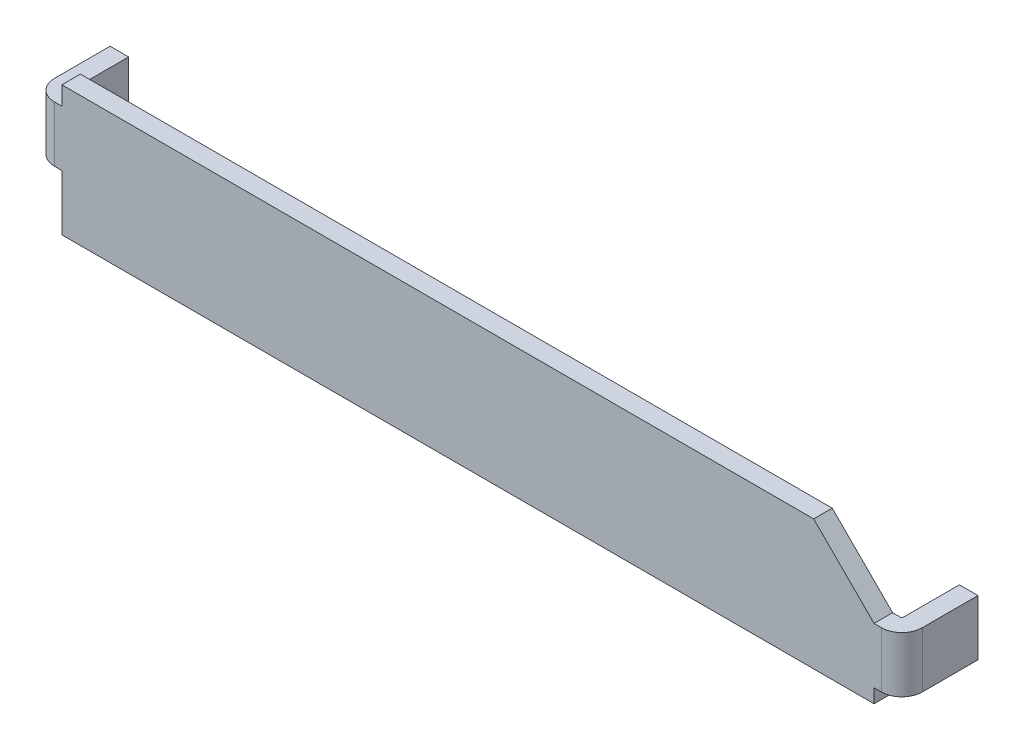
ISO-10303-21;
HEADER;
FILE_DESCRIPTION(('STEP AP214'),'2;1');
FILE_NAME('part.step','',(''),(''),'','','');
FILE_SCHEMA(('AUTOMOTIVE_DESIGN { 1 0 10303 214 1 1 1 1 }'));
ENDSEC;
DATA;
#1=APPLICATION_CONTEXT('core data for automotive mechanical design processes');
#2=APPLICATION_PROTOCOL_DEFINITION('international standard','automotive_design',2000,#1);
#3=PRODUCT_CONTEXT('',#1,'mechanical');
#4=PRODUCT('Part','Part','',(#3));
#5=PRODUCT_RELATED_PRODUCT_CATEGORY('part','',(#4));
#6=PRODUCT_DEFINITION_FORMATION('','',#4);
#7=PRODUCT_DEFINITION_CONTEXT('part definition',#1,'design');
#8=PRODUCT_DEFINITION('design','',#6,#7);
#9=PRODUCT_DEFINITION_SHAPE('','',#8);
#10=(LENGTH_UNIT() NAMED_UNIT(*) SI_UNIT(.MILLI.,.METRE.));
#11=(NAMED_UNIT(*) PLANE_ANGLE_UNIT() SI_UNIT($,.RADIAN.));
#12=(NAMED_UNIT(*) SI_UNIT($,.STERADIAN.) SOLID_ANGLE_UNIT());
#13=UNCERTAINTY_MEASURE_WITH_UNIT(LENGTH_MEASURE(1.E-05),#10,'distance_accuracy_value','');
#14=(GEOMETRIC_REPRESENTATION_CONTEXT(3) GLOBAL_UNCERTAINTY_ASSIGNED_CONTEXT((#13)) GLOBAL_UNIT_ASSIGNED_CONTEXT((#10,
#11,#12)) REPRESENTATION_CONTEXT('',''));
#15=CARTESIAN_POINT('',(0.,0.,0.));
#16=DIRECTION('',(0.,0.,1.));
#17=DIRECTION('',(1.,0.,0.));
#18=AXIS2_PLACEMENT_3D('',#15,#16,#17);
#19=CARTESIAN_POINT('',(-1.,5.9999987,-1.6));
#20=DIRECTION('',(0.,1.,0.));
#21=DIRECTION('',(1.,0.,0.));
#22=AXIS2_PLACEMENT_3D('',#19,#20,#21);
#23=PLANE('',#22);
#24=DIRECTION('',(0.,0.,1.));
#25=VECTOR('',#24,1.);
#26=CARTESIAN_POINT('',(-1.5,5.9999987,-3.1));
#27=LINE('',#26,#25);
#28=CARTESIAN_POINT('',(-1.5,5.9999987,-3.1));
#29=VERTEX_POINT('',#28);
#30=CARTESIAN_POINT('',(-1.5,5.9999987,-0.1));
#31=VERTEX_POINT('',#30);
#32=EDGE_CURVE('E11',#29,#31,#27,.T.);
#33=ORIENTED_EDGE('',*,*,#32,.T.);
#34=CARTESIAN_POINT('',(-0.4,5.9999987,-0.1));
#35=DIRECTION('',(0.,-1.,0.));
#36=DIRECTION('',(0.,0.,1.));
#37=AXIS2_PLACEMENT_3D('',#34,#35,#36);
#38=CIRCLE('',#37,1.1);
#39=CARTESIAN_POINT('',(-0.4,5.9999987,1.));
#40=VERTEX_POINT('',#39);
#41=EDGE_CURVE('E25',#40,#31,#38,.T.);
#42=ORIENTED_EDGE('',*,*,#41,.F.);
#43=DIRECTION('',(-1.,0.,0.));
#44=VECTOR('',#43,1.);
#45=CARTESIAN_POINT('',(0.,5.9999987,1.));
#46=LINE('',#45,#44);
#47=CARTESIAN_POINT('',(0.,5.9999987,1.));
#48=VERTEX_POINT('',#47);
#49=EDGE_CURVE('E263',#48,#40,#46,.T.);
#50=ORIENTED_EDGE('',*,*,#49,.F.);
#51=DIRECTION('',(0.,0.,1.));
#52=VECTOR('',#51,1.);
#53=CARTESIAN_POINT('',(0.,5.9999987,0.));
#54=LINE('',#53,#52);
#55=CARTESIAN_POINT('',(0.,5.9999987,0.));
#56=VERTEX_POINT('',#55);
#57=EDGE_CURVE('E281',#56,#48,#54,.T.);
#58=ORIENTED_EDGE('',*,*,#57,.F.);
#59=DIRECTION('',(-1.,0.,0.));
#60=VECTOR('',#59,1.);
#61=CARTESIAN_POINT('',(0.,5.9999987,0.));
#62=LINE('',#61,#60);
#63=CARTESIAN_POINT('',(-0.4,5.9999987,0.));
#64=VERTEX_POINT('',#63);
#65=EDGE_CURVE('E264',#56,#64,#62,.T.);
#66=ORIENTED_EDGE('',*,*,#65,.T.);
#67=CARTESIAN_POINT('',(-0.4,5.9999987,-0.1));
#68=DIRECTION('',(0.,1.,0.));
#69=DIRECTION('',(-1.,0.,0.));
#70=AXIS2_PLACEMENT_3D('',#67,#68,#69);
#71=CIRCLE('',#70,0.1);
#72=CARTESIAN_POINT('',(-0.5,5.9999987,-0.1));
#73=VERTEX_POINT('',#72);
#74=EDGE_CURVE('E394',#73,#64,#71,.T.);
#75=ORIENTED_EDGE('',*,*,#74,.F.);
#76=DIRECTION('',(0.,0.,1.));
#77=VECTOR('',#76,1.);
#78=CARTESIAN_POINT('',(-0.5,5.9999987,-3.1));
#79=LINE('',#78,#77);
#80=CARTESIAN_POINT('',(-0.5,5.9999987,-3.1));
#81=VERTEX_POINT('',#80);
#82=EDGE_CURVE('E404',#81,#73,#79,.T.);
#83=ORIENTED_EDGE('',*,*,#82,.F.);
#84=DIRECTION('',(-1.,0.,0.));
#85=VECTOR('',#84,1.);
#86=CARTESIAN_POINT('',(-0.5,5.9999987,-3.1));
#87=LINE('',#86,#85);
#88=EDGE_CURVE('E306',#81,#29,#87,.T.);
#89=ORIENTED_EDGE('',*,*,#88,.T.);
#90=EDGE_LOOP('',(#33,#42,#50,#58,#66,#75,#83,#89));
#91=FACE_BOUND('',#90,.T.);
#92=ADVANCED_FACE('F17',(#91),#23,.T.);
#93=CARTESIAN_POINT('',(-1.5,6.9999987,1.));
#94=DIRECTION('',(-1.,0.,0.));
#95=DIRECTION('',(0.,0.,1.));
#96=AXIS2_PLACEMENT_3D('',#93,#94,#95);
#97=PLANE('',#96);
#98=ORIENTED_EDGE('',*,*,#32,.F.);
#99=DIRECTION('',(0.,1.,0.));
#100=VECTOR('',#99,1.);
#101=CARTESIAN_POINT('',(-1.5,3.,-3.1));
#102=LINE('',#101,#100);
#103=CARTESIAN_POINT('',(-1.5,3.,-3.1));
#104=VERTEX_POINT('',#103);
#105=EDGE_CURVE('E301',#104,#29,#102,.T.);
#106=ORIENTED_EDGE('',*,*,#105,.F.);
#107=DIRECTION('',(0.,0.,-1.));
#108=VECTOR('',#107,1.);
#109=CARTESIAN_POINT('',(-1.5,3.,-0.1));
#110=LINE('',#109,#108);
#111=CARTESIAN_POINT('',(-1.5,3.,-0.1));
#112=VERTEX_POINT('',#111);
#113=EDGE_CURVE('E278',#112,#104,#110,.T.);
#114=ORIENTED_EDGE('',*,*,#113,.F.);
#115=DIRECTION('',(0.,1.,0.));
#116=VECTOR('',#115,1.);
#117=CARTESIAN_POINT('',(-1.5,3.,-0.1));
#118=LINE('',#117,#116);
#119=EDGE_CURVE('E44',#112,#31,#118,.T.);
#120=ORIENTED_EDGE('',*,*,#119,.T.);
#121=EDGE_LOOP('',(#98,#106,#114,#120));
#122=FACE_BOUND('',#121,.T.);
#123=ADVANCED_FACE('F418',(#122),#97,.T.);
#124=CARTESIAN_POINT('',(-0.4,3.,-0.1));
#125=DIRECTION('',(0.,1.,0.));
#126=DIRECTION('',(-1.,0.,0.));
#127=AXIS2_PLACEMENT_3D('',#124,#125,#126);
#128=CYLINDRICAL_SURFACE('',#127,1.1);
#129=ORIENTED_EDGE('',*,*,#119,.F.);
#130=CARTESIAN_POINT('',(-0.4,3.,-0.1));
#131=DIRECTION('',(0.,1.,0.));
#132=DIRECTION('',(-1.,0.,0.));
#133=AXIS2_PLACEMENT_3D('',#130,#131,#132);
#134=CIRCLE('',#133,1.1);
#135=CARTESIAN_POINT('',(-0.4,3.,1.));
#136=VERTEX_POINT('',#135);
#137=EDGE_CURVE('E282',#112,#136,#134,.T.);
#138=ORIENTED_EDGE('',*,*,#137,.T.);
#139=DIRECTION('',(0.,-1.,0.));
#140=VECTOR('',#139,1.);
#141=CARTESIAN_POINT('',(-0.4,5.9999987,1.));
#142=LINE('',#141,#140);
#143=EDGE_CURVE('E258',#40,#136,#142,.T.);
#144=ORIENTED_EDGE('',*,*,#143,.F.);
#145=ORIENTED_EDGE('',*,*,#41,.T.);
#146=EDGE_LOOP('',(#129,#138,#144,#145));
#147=FACE_BOUND('',#146,.T.);
#148=ADVANCED_FACE('F427',(#147),#128,.T.);
#149=CARTESIAN_POINT('',(0.,3.49999935,0.5));
#150=DIRECTION('',(1.,0.,0.));
#151=DIRECTION('',(0.,1.,0.));
#152=AXIS2_PLACEMENT_3D('',#149,#150,#151);
#153=PLANE('',#152);
#154=ORIENTED_EDGE('',*,*,#57,.T.);
#155=DIRECTION('',(0.,-1.,0.));
#156=VECTOR('',#155,1.);
#157=CARTESIAN_POINT('',(0.,6.9999987,1.));
#158=LINE('',#157,#156);
#159=CARTESIAN_POINT('',(0.,6.9999987,1.));
#160=VERTEX_POINT('',#159);
#161=EDGE_CURVE('E287',#160,#48,#158,.T.);
#162=ORIENTED_EDGE('',*,*,#161,.F.);
#163=DIRECTION('',(0.,0.,-1.));
#164=VECTOR('',#163,1.);
#165=CARTESIAN_POINT('',(0.,6.9999987,1.));
#166=LINE('',#165,#164);
#167=CARTESIAN_POINT('',(0.,6.9999987,0.));
#168=VERTEX_POINT('',#167);
#169=EDGE_CURVE('E340',#160,#168,#166,.T.);
#170=ORIENTED_EDGE('',*,*,#169,.T.);
#171=DIRECTION('',(0.,-1.,0.));
#172=VECTOR('',#171,1.);
#173=CARTESIAN_POINT('',(0.,6.9999987,0.));
#174=LINE('',#173,#172);
#175=EDGE_CURVE('E268',#168,#56,#174,.T.);
#176=ORIENTED_EDGE('',*,*,#175,.T.);
#177=EDGE_LOOP('',(#154,#162,#170,#176));
#178=FACE_BOUND('',#177,.T.);
#179=ADVANCED_FACE('F435',(#178),#153,.F.);
#180=CARTESIAN_POINT('',(-0.75,3.,0.5));
#181=DIRECTION('',(0.,1.,0.));
#182=DIRECTION('',(1.,0.,0.));
#183=AXIS2_PLACEMENT_3D('',#180,#181,#182);
#184=PLANE('',#183);
#185=DIRECTION('',(1.,0.,0.));
#186=VECTOR('',#185,1.);
#187=CARTESIAN_POINT('',(-0.4,3.,1.));
#188=LINE('',#187,#186);
#189=CARTESIAN_POINT('',(0.,3.,1.));
#190=VERTEX_POINT('',#189);
#191=EDGE_CURVE('E262',#136,#190,#188,.T.);
#192=ORIENTED_EDGE('',*,*,#191,.F.);
#193=ORIENTED_EDGE('',*,*,#137,.F.);
#194=ORIENTED_EDGE('',*,*,#113,.T.);
#195=DIRECTION('',(-1.,0.,0.));
#196=VECTOR('',#195,1.);
#197=CARTESIAN_POINT('',(-0.5,3.,-3.1));
#198=LINE('',#197,#196);
#199=CARTESIAN_POINT('',(-0.5,3.,-3.1));
#200=VERTEX_POINT('',#199);
#201=EDGE_CURVE('E325',#200,#104,#198,.T.);
#202=ORIENTED_EDGE('',*,*,#201,.F.);
#203=DIRECTION('',(0.,0.,-1.));
#204=VECTOR('',#203,1.);
#205=CARTESIAN_POINT('',(-0.5,3.,-0.1));
#206=LINE('',#205,#204);
#207=CARTESIAN_POINT('',(-0.5,3.,-0.1));
#208=VERTEX_POINT('',#207);
#209=EDGE_CURVE('E344',#208,#200,#206,.T.);
#210=ORIENTED_EDGE('',*,*,#209,.F.);
#211=CARTESIAN_POINT('',(-0.4,3.,-0.1));
#212=DIRECTION('',(0.,-1.,0.));
#213=DIRECTION('',(0.,0.,1.));
#214=AXIS2_PLACEMENT_3D('',#211,#212,#213);
#215=CIRCLE('',#214,0.1);
#216=CARTESIAN_POINT('',(-0.4,3.,0.));
#217=VERTEX_POINT('',#216);
#218=EDGE_CURVE('E236',#217,#208,#215,.T.);
#219=ORIENTED_EDGE('',*,*,#218,.F.);
#220=DIRECTION('',(1.,0.,0.));
#221=VECTOR('',#220,1.);
#222=CARTESIAN_POINT('',(-0.4,3.,0.));
#223=LINE('',#222,#221);
#224=CARTESIAN_POINT('',(0.,3.,0.));
#225=VERTEX_POINT('',#224);
#226=EDGE_CURVE('E273',#217,#225,#223,.T.);
#227=ORIENTED_EDGE('',*,*,#226,.T.);
#228=DIRECTION('',(0.,0.,1.));
#229=VECTOR('',#228,1.);
#230=CARTESIAN_POINT('',(0.,3.,0.));
#231=LINE('',#230,#229);
#232=EDGE_CURVE('E387',#225,#190,#231,.T.);
#233=ORIENTED_EDGE('',*,*,#232,.T.);
#234=EDGE_LOOP('',(#192,#193,#194,#202,#210,#219,#227,#233));
#235=FACE_BOUND('',#234,.T.);
#236=ADVANCED_FACE('F425',(#235),#184,.F.);
#237=CARTESIAN_POINT('',(0.,3.49999935,0.5));
#238=DIRECTION('',(1.,0.,0.));
#239=DIRECTION('',(0.,1.,0.));
#240=AXIS2_PLACEMENT_3D('',#237,#238,#239);
#241=PLANE('',#240);
#242=ORIENTED_EDGE('',*,*,#232,.F.);
#243=DIRECTION('',(0.,-1.,0.));
#244=VECTOR('',#243,1.);
#245=CARTESIAN_POINT('',(0.,3.,0.));
#246=LINE('',#245,#244);
#247=CARTESIAN_POINT('',(0.,0.,0.));
#248=VERTEX_POINT('',#247);
#249=EDGE_CURVE('E245',#225,#248,#246,.T.);
#250=ORIENTED_EDGE('',*,*,#249,.T.);
#251=DIRECTION('',(0.,0.,-1.));
#252=VECTOR('',#251,1.);
#253=CARTESIAN_POINT('',(0.,0.,1.));
#254=LINE('',#253,#252);
#255=CARTESIAN_POINT('',(0.,0.,1.));
#256=VERTEX_POINT('',#255);
#257=EDGE_CURVE('E397',#256,#248,#254,.T.);
#258=ORIENTED_EDGE('',*,*,#257,.F.);
#259=DIRECTION('',(0.,-1.,0.));
#260=VECTOR('',#259,1.);
#261=CARTESIAN_POINT('',(0.,3.,1.));
#262=LINE('',#261,#260);
#263=EDGE_CURVE('E369',#190,#256,#262,.T.);
#264=ORIENTED_EDGE('',*,*,#263,.F.);
#265=EDGE_LOOP('',(#242,#250,#258,#264));
#266=FACE_BOUND('',#265,.T.);
#267=ADVANCED_FACE('F477',(#266),#241,.F.);
#268=CARTESIAN_POINT('',(21.8750007,0.,0.5));
#269=DIRECTION('',(0.,1.,0.));
#270=DIRECTION('',(1.,0.,0.));
#271=AXIS2_PLACEMENT_3D('',#268,#269,#270);
#272=PLANE('',#271);
#273=DIRECTION('',(1.,0.,0.));
#274=VECTOR('',#273,1.);
#275=CARTESIAN_POINT('',(0.,0.,0.));
#276=LINE('',#275,#274);
#277=CARTESIAN_POINT('',(43.7500014,0.,0.));
#278=VERTEX_POINT('',#277);
#279=EDGE_CURVE('E241',#248,#278,#276,.T.);
#280=ORIENTED_EDGE('',*,*,#279,.T.);
#281=DIRECTION('',(0.,0.,-1.));
#282=VECTOR('',#281,1.);
#283=CARTESIAN_POINT('',(43.7500014,0.,1.));
#284=LINE('',#283,#282);
#285=CARTESIAN_POINT('',(43.7500014,0.,1.));
#286=VERTEX_POINT('',#285);
#287=EDGE_CURVE('E256',#286,#278,#284,.T.);
#288=ORIENTED_EDGE('',*,*,#287,.F.);
#289=DIRECTION('',(1.,0.,0.));
#290=VECTOR('',#289,1.);
#291=CARTESIAN_POINT('',(0.,0.,1.));
#292=LINE('',#291,#290);
#293=EDGE_CURVE('E257',#256,#286,#292,.T.);
#294=ORIENTED_EDGE('',*,*,#293,.F.);
#295=ORIENTED_EDGE('',*,*,#257,.T.);
#296=EDGE_LOOP('',(#280,#288,#294,#295));
#297=FACE_BOUND('',#296,.T.);
#298=ADVANCED_FACE('F473',(#297),#272,.F.);
#299=CARTESIAN_POINT('',(44.2500014,0.,1.));
#300=DIRECTION('',(1.,0.,0.));
#301=DIRECTION('',(0.,1.,0.));
#302=AXIS2_PLACEMENT_3D('',#299,#300,#301);
#303=PLANE('',#302);
#304=DIRECTION('',(0.,0.,1.));
#305=VECTOR('',#304,1.);
#306=CARTESIAN_POINT('',(44.2500014,0.75,-3.1));
#307=LINE('',#306,#305);
#308=CARTESIAN_POINT('',(44.2500014,0.75,-3.1));
#309=VERTEX_POINT('',#308);
#310=CARTESIAN_POINT('',(44.2500014,0.75,-0.1));
#311=VERTEX_POINT('',#310);
#312=EDGE_CURVE('E381',#309,#311,#307,.T.);
#313=ORIENTED_EDGE('',*,*,#312,.T.);
#314=DIRECTION('',(0.,1.,0.));
#315=VECTOR('',#314,1.);
#316=CARTESIAN_POINT('',(44.2500014,0.75,-0.1));
#317=LINE('',#316,#315);
#318=CARTESIAN_POINT('',(44.2500014,3.74999758,-0.1));
#319=VERTEX_POINT('',#318);
#320=EDGE_CURVE('E343',#311,#319,#317,.T.);
#321=ORIENTED_EDGE('',*,*,#320,.T.);
#322=DIRECTION('',(0.,0.,-1.));
#323=VECTOR('',#322,1.);
#324=CARTESIAN_POINT('',(44.2500014,3.74999758,-0.1));
#325=LINE('',#324,#323);
#326=CARTESIAN_POINT('',(44.2500014,3.74999758,-3.1));
#327=VERTEX_POINT('',#326);
#328=EDGE_CURVE('E314',#319,#327,#325,.T.);
#329=ORIENTED_EDGE('',*,*,#328,.T.);
#330=DIRECTION('',(0.,-1.,0.));
#331=VECTOR('',#330,1.);
#332=CARTESIAN_POINT('',(44.2500014,3.74999758,-3.1));
#333=LINE('',#332,#331);
#334=EDGE_CURVE('E329',#327,#309,#333,.T.);
#335=ORIENTED_EDGE('',*,*,#334,.T.);
#336=EDGE_LOOP('',(#313,#321,#329,#335));
#337=FACE_BOUND('',#336,.T.);
#338=ADVANCED_FACE('F781',(#337),#303,.F.);
#339=CARTESIAN_POINT('',(44.1500014,3.74999758,-0.1));
#340=DIRECTION('',(0.,-1.,0.));
#341=DIRECTION('',(1.,0.,0.));
#342=AXIS2_PLACEMENT_3D('',#339,#340,#341);
#343=CYLINDRICAL_SURFACE('',#342,0.1);
#344=ORIENTED_EDGE('',*,*,#320,.F.);
#345=CARTESIAN_POINT('',(44.1500014,0.75,-0.1));
#346=DIRECTION('',(0.,-1.,0.));
#347=DIRECTION('',(1.,0.,0.));
#348=AXIS2_PLACEMENT_3D('',#345,#346,#347);
#349=CIRCLE('',#348,0.1);
#350=CARTESIAN_POINT('',(44.1500014,0.75,0.));
#351=VERTEX_POINT('',#350);
#352=EDGE_CURVE('E378',#311,#351,#349,.T.);
#353=ORIENTED_EDGE('',*,*,#352,.T.);
#354=DIRECTION('',(0.,-1.,0.));
#355=VECTOR('',#354,1.);
#356=CARTESIAN_POINT('',(44.1500014,3.74999758,0.));
#357=LINE('',#356,#355);
#358=CARTESIAN_POINT('',(44.1500014,3.74999758,0.));
#359=VERTEX_POINT('',#358);
#360=EDGE_CURVE('E222',#359,#351,#357,.T.);
#361=ORIENTED_EDGE('',*,*,#360,.F.);
#362=CARTESIAN_POINT('',(44.1500014,3.74999758,-0.1));
#363=DIRECTION('',(0.,1.,0.));
#364=DIRECTION('',(0.,0.,1.));
#365=AXIS2_PLACEMENT_3D('',#362,#363,#364);
#366=CIRCLE('',#365,0.1);
#367=EDGE_CURVE('E217',#359,#319,#366,.T.);
#368=ORIENTED_EDGE('',*,*,#367,.T.);
#369=EDGE_LOOP('',(#344,#353,#361,#368));
#370=FACE_BOUND('',#369,.T.);
#371=ADVANCED_FACE('F462',(#370),#343,.F.);
#372=CARTESIAN_POINT('',(20.25000014,6.9999987,0.5));
#373=DIRECTION('',(0.,-1.,0.));
#374=DIRECTION('',(0.,0.,-1.));
#375=AXIS2_PLACEMENT_3D('',#372,#373,#374);
#376=PLANE('',#375);
#377=DIRECTION('',(-1.,0.,0.));
#378=VECTOR('',#377,1.);
#379=CARTESIAN_POINT('',(40.50000028,6.9999987,0.));
#380=LINE('',#379,#378);
#381=CARTESIAN_POINT('',(40.50000028,6.9999987,0.));
#382=VERTEX_POINT('',#381);
#383=EDGE_CURVE('E228',#382,#168,#380,.T.);
#384=ORIENTED_EDGE('',*,*,#383,.T.);
#385=ORIENTED_EDGE('',*,*,#169,.F.);
#386=DIRECTION('',(-1.,0.,0.));
#387=VECTOR('',#386,1.);
#388=CARTESIAN_POINT('',(40.50000028,6.9999987,1.));
#389=LINE('',#388,#387);
#390=CARTESIAN_POINT('',(40.5000002799998,6.9999987,1.));
#391=VERTEX_POINT('',#390);
#392=EDGE_CURVE('E283',#391,#160,#389,.T.);
#393=ORIENTED_EDGE('',*,*,#392,.F.);
#394=DIRECTION('',(0.,0.,-1.));
#395=VECTOR('',#394,1.);
#396=CARTESIAN_POINT('',(40.5000002799999,6.99999869999988,1.));
#397=LINE('',#396,#395);
#398=EDGE_CURVE('E318',#391,#382,#397,.T.);
#399=ORIENTED_EDGE('',*,*,#398,.T.);
#400=EDGE_LOOP('',(#384,#385,#393,#399));
#401=FACE_BOUND('',#400,.T.);
#402=ADVANCED_FACE('F761',(#401),#376,.F.);
#403=CARTESIAN_POINT('',(-0.5,6.9999987,1.));
#404=DIRECTION('',(-1.,0.,0.));
#405=DIRECTION('',(0.,0.,1.));
#406=AXIS2_PLACEMENT_3D('',#403,#404,#405);
#407=PLANE('',#406);
#408=ORIENTED_EDGE('',*,*,#82,.T.);
#409=DIRECTION('',(0.,-1.,0.));
#410=VECTOR('',#409,1.);
#411=CARTESIAN_POINT('',(-0.5,5.9999987,-0.1));
#412=LINE('',#411,#410);
#413=EDGE_CURVE('E322',#73,#208,#412,.T.);
#414=ORIENTED_EDGE('',*,*,#413,.T.);
#415=ORIENTED_EDGE('',*,*,#209,.T.);
#416=DIRECTION('',(0.,1.,0.));
#417=VECTOR('',#416,1.);
#418=CARTESIAN_POINT('',(-0.5,3.,-3.1));
#419=LINE('',#418,#417);
#420=EDGE_CURVE('E309',#200,#81,#419,.T.);
#421=ORIENTED_EDGE('',*,*,#420,.T.);
#422=EDGE_LOOP('',(#408,#414,#415,#421));
#423=FACE_BOUND('',#422,.T.);
#424=ADVANCED_FACE('F447',(#423),#407,.F.);
#425=CARTESIAN_POINT('',(44.7500014,2.24999879,-3.1));
#426=DIRECTION('',(0.,0.,-1.));
#427=DIRECTION('',(0.,-1.,0.));
#428=AXIS2_PLACEMENT_3D('',#425,#426,#427);
#429=PLANE('',#428);
#430=DIRECTION('',(0.,-1.,0.));
#431=VECTOR('',#430,1.);
#432=CARTESIAN_POINT('',(45.2500014,3.74999758,-3.1));
#433=LINE('',#432,#431);
#434=CARTESIAN_POINT('',(45.2500014,3.74999758,-3.1));
#435=VERTEX_POINT('',#434);
#436=CARTESIAN_POINT('',(45.2500014,0.75,-3.1));
#437=VERTEX_POINT('',#436);
#438=EDGE_CURVE('E298',#435,#437,#433,.T.);
#439=ORIENTED_EDGE('',*,*,#438,.T.);
#440=DIRECTION('',(1.,0.,0.));
#441=VECTOR('',#440,1.);
#442=CARTESIAN_POINT('',(44.2500014,0.75,-3.1));
#443=LINE('',#442,#441);
#444=EDGE_CURVE('E251',#309,#437,#443,.T.);
#445=ORIENTED_EDGE('',*,*,#444,.F.);
#446=ORIENTED_EDGE('',*,*,#334,.F.);
#447=DIRECTION('',(1.,0.,0.));
#448=VECTOR('',#447,1.);
#449=CARTESIAN_POINT('',(44.2500014,3.74999758,-3.1));
#450=LINE('',#449,#448);
#451=EDGE_CURVE('E310',#327,#435,#450,.T.);
#452=ORIENTED_EDGE('',*,*,#451,.T.);
#453=EDGE_LOOP('',(#439,#445,#446,#452));
#454=FACE_BOUND('',#453,.T.);
#455=ADVANCED_FACE('F741',(#454),#429,.T.);
#456=CARTESIAN_POINT('',(-1.,4.49999935,-3.1));
#457=DIRECTION('',(0.,0.,-1.));
#458=DIRECTION('',(0.,-1.,0.));
#459=AXIS2_PLACEMENT_3D('',#456,#457,#458);
#460=PLANE('',#459);
#461=ORIENTED_EDGE('',*,*,#105,.T.);
#462=ORIENTED_EDGE('',*,*,#88,.F.);
#463=ORIENTED_EDGE('',*,*,#420,.F.);
#464=ORIENTED_EDGE('',*,*,#201,.T.);
#465=EDGE_LOOP('',(#461,#462,#463,#464));
#466=FACE_BOUND('',#465,.T.);
#467=ADVANCED_FACE('F451',(#466),#460,.T.);
#468=CARTESIAN_POINT('',(45.2500014,0.,1.));
#469=DIRECTION('',(1.,0.,0.));
#470=DIRECTION('',(0.,1.,0.));
#471=AXIS2_PLACEMENT_3D('',#468,#469,#470);
#472=PLANE('',#471);
#473=DIRECTION('',(0.,0.,1.));
#474=VECTOR('',#473,1.);
#475=CARTESIAN_POINT('',(45.2500014,0.75,-3.1));
#476=LINE('',#475,#474);
#477=CARTESIAN_POINT('',(45.2500014,0.75,-0.1));
#478=VERTEX_POINT('',#477);
#479=EDGE_CURVE('E247',#437,#478,#476,.T.);
#480=ORIENTED_EDGE('',*,*,#479,.F.);
#481=ORIENTED_EDGE('',*,*,#438,.F.);
#482=DIRECTION('',(0.,0.,-1.));
#483=VECTOR('',#482,1.);
#484=CARTESIAN_POINT('',(45.2500014,3.74999758,-0.1));
#485=LINE('',#484,#483);
#486=CARTESIAN_POINT('',(45.2500014,3.74999758,-0.1));
#487=VERTEX_POINT('',#486);
#488=EDGE_CURVE('E315',#487,#435,#485,.T.);
#489=ORIENTED_EDGE('',*,*,#488,.F.);
#490=DIRECTION('',(0.,-1.,0.));
#491=VECTOR('',#490,1.);
#492=CARTESIAN_POINT('',(45.2500014,3.74999758,-0.1));
#493=LINE('',#492,#491);
#494=EDGE_CURVE('E302',#487,#478,#493,.T.);
#495=ORIENTED_EDGE('',*,*,#494,.T.);
#496=EDGE_LOOP('',(#480,#481,#489,#495));
#497=FACE_BOUND('',#496,.T.);
#498=ADVANCED_FACE('F720',(#497),#472,.T.);
#499=CARTESIAN_POINT('',(44.1500014,3.74999758,-0.1));
#500=DIRECTION('',(0.,-1.,0.));
#501=DIRECTION('',(1.,0.,0.));
#502=AXIS2_PLACEMENT_3D('',#499,#500,#501);
#503=CYLINDRICAL_SURFACE('',#502,1.1);
#504=ORIENTED_EDGE('',*,*,#494,.F.);
#505=CARTESIAN_POINT('',(44.1500014,3.74999758,-0.1));
#506=DIRECTION('',(0.,-1.,0.));
#507=DIRECTION('',(1.,0.,0.));
#508=AXIS2_PLACEMENT_3D('',#505,#506,#507);
#509=CIRCLE('',#508,1.1);
#510=CARTESIAN_POINT('',(44.1500014,3.74999758,1.));
#511=VERTEX_POINT('',#510);
#512=EDGE_CURVE('E240',#487,#511,#509,.T.);
#513=ORIENTED_EDGE('',*,*,#512,.T.);
#514=DIRECTION('',(0.,1.,0.));
#515=VECTOR('',#514,1.);
#516=CARTESIAN_POINT('',(44.1500014,0.75,1.));
#517=LINE('',#516,#515);
#518=CARTESIAN_POINT('',(44.1500014,0.75,1.));
#519=VERTEX_POINT('',#518);
#520=EDGE_CURVE('E288',#519,#511,#517,.T.);
#521=ORIENTED_EDGE('',*,*,#520,.F.);
#522=CARTESIAN_POINT('',(44.1500014,0.75,-0.1));
#523=DIRECTION('',(0.,1.,0.));
#524=DIRECTION('',(0.,0.,1.));
#525=AXIS2_PLACEMENT_3D('',#522,#523,#524);
#526=CIRCLE('',#525,1.1);
#527=EDGE_CURVE('E250',#519,#478,#526,.T.);
#528=ORIENTED_EDGE('',*,*,#527,.T.);
#529=EDGE_LOOP('',(#504,#513,#521,#528));
#530=FACE_BOUND('',#529,.T.);
#531=ADVANCED_FACE('F711',(#530),#503,.T.);
#532=CARTESIAN_POINT('',(-0.4,3.,-0.1));
#533=DIRECTION('',(0.,1.,0.));
#534=DIRECTION('',(-1.,0.,0.));
#535=AXIS2_PLACEMENT_3D('',#532,#533,#534);
#536=CYLINDRICAL_SURFACE('',#535,0.1);
#537=ORIENTED_EDGE('',*,*,#413,.F.);
#538=ORIENTED_EDGE('',*,*,#74,.T.);
#539=DIRECTION('',(0.,1.,0.));
#540=VECTOR('',#539,1.);
#541=CARTESIAN_POINT('',(-0.4,3.,0.));
#542=LINE('',#541,#540);
#543=EDGE_CURVE('E269',#217,#64,#542,.T.);
#544=ORIENTED_EDGE('',*,*,#543,.F.);
#545=ORIENTED_EDGE('',*,*,#218,.T.);
#546=EDGE_LOOP('',(#537,#538,#544,#545));
#547=FACE_BOUND('',#546,.T.);
#548=ADVANCED_FACE('F442',(#547),#536,.F.);
#549=CARTESIAN_POINT('',(44.5000014,0.75,0.5));
#550=DIRECTION('',(0.,1.,0.));
#551=DIRECTION('',(1.,0.,0.));
#552=AXIS2_PLACEMENT_3D('',#549,#550,#551);
#553=PLANE('',#552);
#554=DIRECTION('',(1.,0.,0.));
#555=VECTOR('',#554,1.);
#556=CARTESIAN_POINT('',(43.7500014,0.75,1.));
#557=LINE('',#556,#555);
#558=CARTESIAN_POINT('',(43.7500014,0.75,1.));
#559=VERTEX_POINT('',#558);
#560=EDGE_CURVE('E354',#559,#519,#557,.T.);
#561=ORIENTED_EDGE('',*,*,#560,.F.);
#562=DIRECTION('',(0.,0.,1.));
#563=VECTOR('',#562,1.);
#564=CARTESIAN_POINT('',(43.7500014,0.75,0.));
#565=LINE('',#564,#563);
#566=CARTESIAN_POINT('',(43.7500014,0.75,0.));
#567=VERTEX_POINT('',#566);
#568=EDGE_CURVE('E253',#567,#559,#565,.T.);
#569=ORIENTED_EDGE('',*,*,#568,.F.);
#570=DIRECTION('',(1.,0.,0.));
#571=VECTOR('',#570,1.);
#572=CARTESIAN_POINT('',(43.7500014,0.75,0.));
#573=LINE('',#572,#571);
#574=EDGE_CURVE('E274',#567,#351,#573,.T.);
#575=ORIENTED_EDGE('',*,*,#574,.T.);
#576=ORIENTED_EDGE('',*,*,#352,.F.);
#577=ORIENTED_EDGE('',*,*,#312,.F.);
#578=ORIENTED_EDGE('',*,*,#444,.T.);
#579=ORIENTED_EDGE('',*,*,#479,.T.);
#580=ORIENTED_EDGE('',*,*,#527,.F.);
#581=EDGE_LOOP('',(#561,#569,#575,#576,#577,#578,#579,#580));
#582=FACE_BOUND('',#581,.T.);
#583=ADVANCED_FACE('F467',(#582),#553,.F.);
#584=CARTESIAN_POINT('',(43.7500014,1.87499879,0.5));
#585=DIRECTION('',(-1.,0.,0.));
#586=DIRECTION('',(0.,0.,1.));
#587=AXIS2_PLACEMENT_3D('',#584,#585,#586);
#588=PLANE('',#587);
#589=ORIENTED_EDGE('',*,*,#568,.T.);
#590=DIRECTION('',(0.,1.,0.));
#591=VECTOR('',#590,1.);
#592=CARTESIAN_POINT('',(43.7500014,0.,1.));
#593=LINE('',#592,#591);
#594=EDGE_CURVE('E350',#286,#559,#593,.T.);
#595=ORIENTED_EDGE('',*,*,#594,.F.);
#596=ORIENTED_EDGE('',*,*,#287,.T.);
#597=DIRECTION('',(0.,1.,0.));
#598=VECTOR('',#597,1.);
#599=CARTESIAN_POINT('',(43.7500014,0.,0.));
#600=LINE('',#599,#598);
#601=EDGE_CURVE('E246',#278,#567,#600,.T.);
#602=ORIENTED_EDGE('',*,*,#601,.T.);
#603=EDGE_LOOP('',(#589,#595,#596,#602));
#604=FACE_BOUND('',#603,.T.);
#605=ADVANCED_FACE('F470',(#604),#588,.F.);
#606=CARTESIAN_POINT('',(0.,0.,1.));
#607=DIRECTION('',(0.,0.,1.));
#608=DIRECTION('',(1.,0.,0.));
#609=AXIS2_PLACEMENT_3D('',#606,#607,#608);
#610=PLANE('',#609);
#611=ORIENTED_EDGE('',*,*,#594,.T.);
#612=ORIENTED_EDGE('',*,*,#560,.T.);
#613=ORIENTED_EDGE('',*,*,#520,.T.);
#614=DIRECTION('',(-1.,0.,0.));
#615=VECTOR('',#614,1.);
#616=CARTESIAN_POINT('',(44.1500014,3.74999758,1.));
#617=LINE('',#616,#615);
#618=CARTESIAN_POINT('',(43.7500014000002,3.74999758,1.));
#619=VERTEX_POINT('',#618);
#620=EDGE_CURVE('E210',#511,#619,#617,.T.);
#621=ORIENTED_EDGE('',*,*,#620,.T.);
#622=DIRECTION('',(0.707106781186597,-0.707106781186498,0.));
#623=VECTOR('',#622,1.);
#624=CARTESIAN_POINT('',(40.50000028,6.9999987,1.));
#625=LINE('',#624,#623);
#626=EDGE_CURVE('E206',#391,#619,#625,.T.);
#627=ORIENTED_EDGE('',*,*,#626,.F.);
#628=ORIENTED_EDGE('',*,*,#392,.T.);
#629=ORIENTED_EDGE('',*,*,#161,.T.);
#630=ORIENTED_EDGE('',*,*,#49,.T.);
#631=ORIENTED_EDGE('',*,*,#143,.T.);
#632=ORIENTED_EDGE('',*,*,#191,.T.);
#633=ORIENTED_EDGE('',*,*,#263,.T.);
#634=ORIENTED_EDGE('',*,*,#293,.T.);
#635=EDGE_LOOP('',(#611,#612,#613,#621,#627,#628,#629,#630,#631,#632,#633,#634));
#636=FACE_BOUND('',#635,.T.);
#637=ADVANCED_FACE('F430',(#636),#610,.T.);
#638=CARTESIAN_POINT('',(44.5000014,3.74999758,0.5));
#639=DIRECTION('',(0.,-1.,0.));
#640=DIRECTION('',(0.,0.,-1.));
#641=AXIS2_PLACEMENT_3D('',#638,#639,#640);
#642=PLANE('',#641);
#643=ORIENTED_EDGE('',*,*,#620,.F.);
#644=ORIENTED_EDGE('',*,*,#512,.F.);
#645=ORIENTED_EDGE('',*,*,#488,.T.);
#646=ORIENTED_EDGE('',*,*,#451,.F.);
#647=ORIENTED_EDGE('',*,*,#328,.F.);
#648=ORIENTED_EDGE('',*,*,#367,.F.);
#649=DIRECTION('',(-1.,0.,0.));
#650=VECTOR('',#649,1.);
#651=CARTESIAN_POINT('',(44.1500014,3.74999758,0.));
#652=LINE('',#651,#650);
#653=CARTESIAN_POINT('',(43.7500014000002,3.74999758,0.));
#654=VERTEX_POINT('',#653);
#655=EDGE_CURVE('E213',#359,#654,#652,.T.);
#656=ORIENTED_EDGE('',*,*,#655,.T.);
#657=DIRECTION('',(0.,0.,-1.));
#658=VECTOR('',#657,1.);
#659=CARTESIAN_POINT('',(43.7500014,3.74999758,1.));
#660=LINE('',#659,#658);
#661=EDGE_CURVE('E199',#619,#654,#660,.T.);
#662=ORIENTED_EDGE('',*,*,#661,.F.);
#663=EDGE_LOOP('',(#643,#644,#645,#646,#647,#648,#656,#662));
#664=FACE_BOUND('',#663,.T.);
#665=ADVANCED_FACE('F214',(#664),#642,.F.);
#666=CARTESIAN_POINT('',(42.12500084,5.37499814,0.5));
#667=DIRECTION('',(-0.707106781186498,-0.707106781186598,0.));
#668=DIRECTION('',(-0.707106781186598,0.707106781186498,0.));
#669=AXIS2_PLACEMENT_3D('',#666,#667,#668);
#670=PLANE('',#669);
#671=DIRECTION('',(-0.707106781186597,0.707106781186498,0.));
#672=VECTOR('',#671,1.);
#673=CARTESIAN_POINT('',(43.7500014000005,3.74999758,0.));
#674=LINE('',#673,#672);
#675=EDGE_CURVE('E204',#654,#382,#674,.T.);
#676=ORIENTED_EDGE('',*,*,#675,.T.);
#677=ORIENTED_EDGE('',*,*,#398,.F.);
#678=ORIENTED_EDGE('',*,*,#626,.T.);
#679=ORIENTED_EDGE('',*,*,#661,.T.);
#680=EDGE_LOOP('',(#676,#677,#678,#679));
#681=FACE_BOUND('',#680,.T.);
#682=ADVANCED_FACE('F201',(#681),#670,.F.);
#683=CARTESIAN_POINT('',(0.,0.,0.));
#684=DIRECTION('',(0.,0.,1.));
#685=DIRECTION('',(1.,0.,0.));
#686=AXIS2_PLACEMENT_3D('',#683,#684,#685);
#687=PLANE('',#686);
#688=ORIENTED_EDGE('',*,*,#675,.F.);
#689=ORIENTED_EDGE('',*,*,#655,.F.);
#690=ORIENTED_EDGE('',*,*,#360,.T.);
#691=ORIENTED_EDGE('',*,*,#574,.F.);
#692=ORIENTED_EDGE('',*,*,#601,.F.);
#693=ORIENTED_EDGE('',*,*,#279,.F.);
#694=ORIENTED_EDGE('',*,*,#249,.F.);
#695=ORIENTED_EDGE('',*,*,#226,.F.);
#696=ORIENTED_EDGE('',*,*,#543,.T.);
#697=ORIENTED_EDGE('',*,*,#65,.F.);
#698=ORIENTED_EDGE('',*,*,#175,.F.);
#699=ORIENTED_EDGE('',*,*,#383,.F.);
#700=EDGE_LOOP('',(#688,#689,#690,#691,#692,#693,#694,#695,#696,#697,#698,#699));
#701=FACE_BOUND('',#700,.T.);
#702=ADVANCED_FACE('F225',(#701),#687,.F.);
#703=CLOSED_SHELL('',(#92,#123,#148,#179,#236,#267,#298,#338,#371,#402,#424,#455,#467,#498,#531,
#548,#583,#605,#637,#665,#682,#702));
#704=MANIFOLD_SOLID_BREP('B1',#703);
#705=ADVANCED_BREP_SHAPE_REPRESENTATION('',(#18,#704),#14);
#706=SHAPE_DEFINITION_REPRESENTATION(#9,#705);
ENDSEC;
END-ISO-10303-21;
